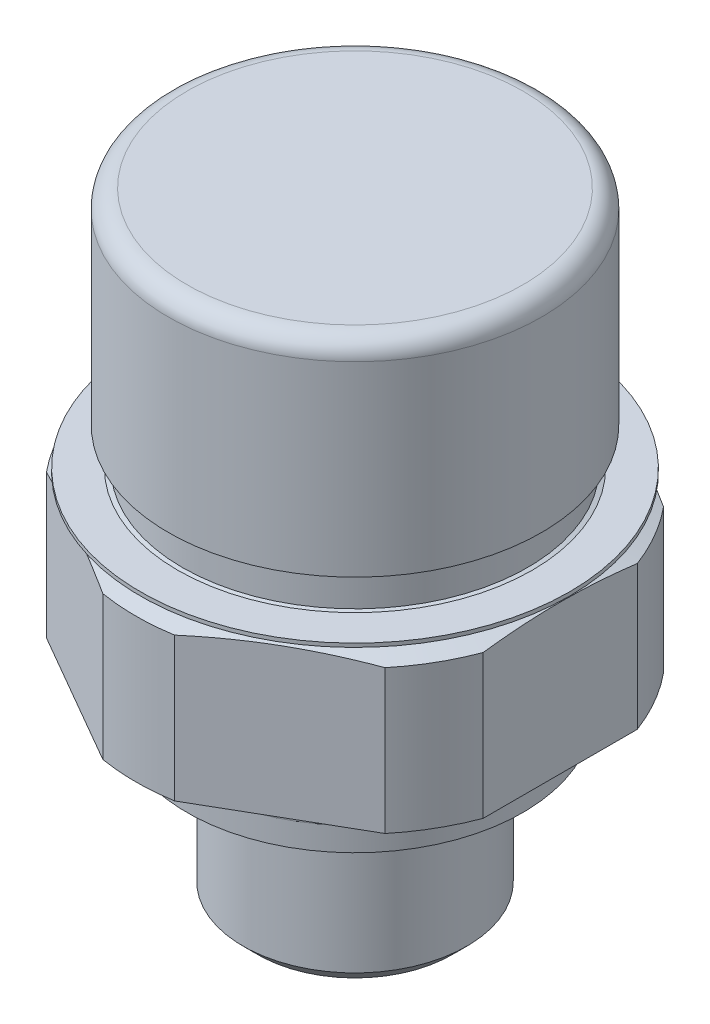
ISO-10303-21;
HEADER;
FILE_DESCRIPTION(('STEP AP214'),'2;1');
FILE_NAME('part.step','',(''),(''),'','','');
FILE_SCHEMA(('AUTOMOTIVE_DESIGN { 1 0 10303 214 1 1 1 1 }'));
ENDSEC;
DATA;
#1=APPLICATION_CONTEXT('core data for automotive mechanical design processes');
#2=APPLICATION_PROTOCOL_DEFINITION('international standard','automotive_design',2000,#1);
#3=PRODUCT_CONTEXT('',#1,'mechanical');
#4=PRODUCT('Part','Part','',(#3));
#5=PRODUCT_RELATED_PRODUCT_CATEGORY('part','',(#4));
#6=PRODUCT_DEFINITION_FORMATION('','',#4);
#7=PRODUCT_DEFINITION_CONTEXT('part definition',#1,'design');
#8=PRODUCT_DEFINITION('design','',#6,#7);
#9=PRODUCT_DEFINITION_SHAPE('','',#8);
#10=(LENGTH_UNIT() NAMED_UNIT(*) SI_UNIT(.MILLI.,.METRE.));
#11=(NAMED_UNIT(*) PLANE_ANGLE_UNIT() SI_UNIT($,.RADIAN.));
#12=(NAMED_UNIT(*) SI_UNIT($,.STERADIAN.) SOLID_ANGLE_UNIT());
#13=UNCERTAINTY_MEASURE_WITH_UNIT(LENGTH_MEASURE(1.E-05),#10,'distance_accuracy_value','');
#14=(GEOMETRIC_REPRESENTATION_CONTEXT(3) GLOBAL_UNCERTAINTY_ASSIGNED_CONTEXT((#13)) GLOBAL_UNIT_ASSIGNED_CONTEXT((#10,
#11,#12)) REPRESENTATION_CONTEXT('',''));
#15=CARTESIAN_POINT('',(0.,0.,0.));
#16=DIRECTION('',(0.,0.,1.));
#17=DIRECTION('',(1.,0.,0.));
#18=AXIS2_PLACEMENT_3D('',#15,#16,#17);
#19=CARTESIAN_POINT('',(0.,11.5,0.));
#20=DIRECTION('',(0.,-1.,0.));
#21=DIRECTION('',(0.,0.,-1.));
#22=AXIS2_PLACEMENT_3D('',#19,#20,#21);
#23=CONICAL_SURFACE('',#22,9.,1.22173047639603);
#24=CARTESIAN_POINT('',(0.,10.4990818557679,0.));
#25=DIRECTION('',(0.,-1.,0.));
#26=DIRECTION('',(0.,0.,-1.));
#27=AXIS2_PLACEMENT_3D('',#24,#25,#26);
#28=CIRCLE('',#27,11.75);
#29=CARTESIAN_POINT('',(11.,10.4990818557679,4.13067791046458));
#30=VERTEX_POINT('',#29);
#31=CARTESIAN_POINT('',(9.07727200531355,10.4990818557679,7.46094048639654));
#32=VERTEX_POINT('',#31);
#33=EDGE_CURVE('E148',#30,#32,#28,.T.);
#34=ORIENTED_EDGE('',*,*,#33,.F.);
#35=CARTESIAN_POINT('',(11.,6.75590904600755,19.0921349584983));
#36=CARTESIAN_POINT('',(11.,6.87474807178604,18.7152833554818));
#37=CARTESIAN_POINT('',(11.,6.9928056435252,18.3381837701922));
#38=CARTESIAN_POINT('',(11.,7.2270814004805,17.5834084022549));
#39=CARTESIAN_POINT('',(11.,7.34329956116789,17.2057326119971));
#40=CARTESIAN_POINT('',(11.,7.57364333418138,16.449647661278));
#41=CARTESIAN_POINT('',(11.,7.68776845885472,16.0712383520636));
#42=CARTESIAN_POINT('',(11.,7.91355008005393,15.3136843475574));
#43=CARTESIAN_POINT('',(11.,8.02520658366512,14.9345396543796));
#44=CARTESIAN_POINT('',(11.,8.24726437654446,14.1698048222856));
#45=CARTESIAN_POINT('',(11.,8.3576227591695,13.7842022049827));
#46=CARTESIAN_POINT('',(11.,8.57484488842874,13.0120139440018));
#47=CARTESIAN_POINT('',(11.,8.68170865089805,12.6254283047867));
#48=CARTESIAN_POINT('',(11.,8.89130375420541,11.8511464817657));
#49=CARTESIAN_POINT('',(11.,8.99403520081575,11.4634503266573));
#50=CARTESIAN_POINT('',(11.,9.19460044105861,10.6867897862054));
#51=CARTESIAN_POINT('',(11.,9.2924342401206,10.2978254022684));
#52=CARTESIAN_POINT('',(11.,9.47822832068293,9.53510411530176));
#53=CARTESIAN_POINT('',(11.,9.56643178705642,9.16140663413521));
#54=CARTESIAN_POINT('',(11.,9.73654082793261,8.41257312414679));
#55=CARTESIAN_POINT('',(11.,9.8184463735271,8.03743708873009));
#56=CARTESIAN_POINT('',(11.,9.97484840060975,7.28558081931047));
#57=CARTESIAN_POINT('',(11.,10.0493442197886,6.90886044682467));
#58=CARTESIAN_POINT('',(11.,10.1896526498076,6.15379020743366));
#59=CARTESIAN_POINT('',(11.,10.2554651363306,5.77544031727911));
#60=CARTESIAN_POINT('',(11.,10.3765569313355,5.02003892816318));
#61=CARTESIAN_POINT('',(11.,10.4319135503916,4.64299991496271));
#62=CARTESIAN_POINT('',(11.,10.5313293428193,3.88745029598032));
#63=CARTESIAN_POINT('',(11.,10.5753893465937,3.50893980044326));
#64=CARTESIAN_POINT('',(11.,10.6509071171795,2.75075306110334));
#65=CARTESIAN_POINT('',(11.,10.682368270039,2.37107715819286));
#66=CARTESIAN_POINT('',(11.,10.731649384444,1.61083205677763));
#67=CARTESIAN_POINT('',(11.,10.7494693201107,1.23026285657958));
#68=CARTESIAN_POINT('',(11.,10.7717555615651,0.434888530660449));
#69=CARTESIAN_POINT('',(11.,10.7748951075862,0.020045097803278));
#70=CARTESIAN_POINT('',(11.,10.7640712199422,-0.809417941482109));
#71=CARTESIAN_POINT('',(11.,10.7501075660731,-1.22403754495976));
#72=CARTESIAN_POINT('',(11.,10.7056917644412,-2.05251048362773));
#73=CARTESIAN_POINT('',(11.,10.6752345882296,-2.46636354648942));
#74=CARTESIAN_POINT('',(11.,10.5990780142224,-3.29264171450689));
#75=CARTESIAN_POINT('',(11.,10.5533784062928,-3.70506679989721));
#76=CARTESIAN_POINT('',(11.,10.3950011395301,-4.94659186883785));
#77=CARTESIAN_POINT('',(11.,10.2614622984955,-5.77306407600658));
#78=CARTESIAN_POINT('',(11.,10.030557454511,-7.00675320095458));
#79=CARTESIAN_POINT('',(11.,9.94848285414917,-7.4170085208227));
#80=CARTESIAN_POINT('',(11.,9.77573164963903,-8.23572034157804));
#81=CARTESIAN_POINT('',(11.,9.68505505720981,-8.64417684491513));
#82=CARTESIAN_POINT('',(11.,9.49197613918598,-9.47903784680741));
#83=CARTESIAN_POINT('',(11.,9.38921946153637,-9.90535967618147));
#84=CARTESIAN_POINT('',(11.,9.17717247619389,-10.7563713620037));
#85=CARTESIAN_POINT('',(11.,9.0678821565188,-11.1810612154574));
#86=CARTESIAN_POINT('',(11.,8.8438933429389,-12.0289894484477));
#87=CARTESIAN_POINT('',(11.,8.72919506224634,-12.4522278845028));
#88=CARTESIAN_POINT('',(11.,8.49529831513801,-13.2974602418844));
#89=CARTESIAN_POINT('',(11.,8.37609981182679,-13.7194541529771));
#90=CARTESIAN_POINT('',(11.,8.13596808729427,-14.5553167228647));
#91=CARTESIAN_POINT('',(11.,8.01509714832268,-14.9692033111902));
#92=CARTESIAN_POINT('',(11.,7.77029269538235,-15.79607024919));
#93=CARTESIAN_POINT('',(11.,7.64635916959943,-16.2090505953617));
#94=CARTESIAN_POINT('',(11.,7.39593564656345,-17.0341114835098));
#95=CARTESIAN_POINT('',(11.,7.26944635428796,-17.4461922397942));
#96=CARTESIAN_POINT('',(11.,7.01424965179622,-18.269658383894));
#97=CARTESIAN_POINT('',(11.,6.8855422825194,-18.68104378439));
#98=CARTESIAN_POINT('',(11.,6.75590904600756,-19.0921349584983));
#99=B_SPLINE_CURVE_WITH_KNOTS('',3,(#35,#36,#37,#38,#39,#40,#41,#42,#43,#44,#45,#46,#47,#48,#49,
#50,#51,#52,#53,#54,#55,#56,#57,#58,#59,#60,#61,#62,#63,#64,#65,#66,#67,#68,#69,#70,#71,#72,#73,
#74,#75,#76,#77,#78,#79,#80,#81,#82,#83,#84,#85,#86,#87,#88,#89,#90,#91,#92,#93,#94,#95,#96,#97,
#98),.UNSPECIFIED.,.F.,.F.,(4,2,2,2,2,2,2,2,2,2,2,2,2,2,2,2,2,2,2,2,2,2,2,2,2,2,2,2,2,2,2,4),
(0.,1.18543739308644,2.3708905808141,3.5566165435785,4.7423391026759,5.94557711106011,
7.14880966647767,8.35201140388794,9.55521180741589,10.7070631970837,11.8589198735715,
13.0108794150146,14.1628554469963,15.305948299226,16.4489570997374,17.5916585004185,
18.7343620689112,19.9785681099575,21.2227901703389,22.4673917756135,23.7120105398161,
26.2218740194445,27.4769833489083,28.7320909684718,30.0476255873544,31.3631626189058,
32.678647827885,33.9941438243214,35.2876551179094,36.5811714021086,37.8743356289115,
39.1674760130758),.UNSPECIFIED.);
#100=CARTESIAN_POINT('',(11.,10.4990818557679,-4.13067791046458));
#101=VERTEX_POINT('',#100);
#102=EDGE_CURVE('E242',#30,#101,#99,.T.);
#103=ORIENTED_EDGE('',*,*,#102,.T.);
#104=CARTESIAN_POINT('',(9.07727200531355,10.4990818557679,-7.46094048639654));
#105=VERTEX_POINT('',#104);
#106=EDGE_CURVE('E136',#105,#101,#28,.T.);
#107=ORIENTED_EDGE('',*,*,#106,.F.);
#108=CARTESIAN_POINT('',(9.07862544622409,10.4988818557679,-7.4601590769225));
#109=CARTESIAN_POINT('',(8.78137305145271,10.5428462724424,-7.63177782706102));
#110=CARTESIAN_POINT('',(8.48356742122965,10.5820359892877,-7.80371598783649));
#111=CARTESIAN_POINT('',(7.88702267637257,10.6500395482173,-8.14813125686338));
#112=CARTESIAN_POINT('',(7.58828341527745,10.6788516704479,-8.32060844967416));
#113=CARTESIAN_POINT('',(6.99144551971995,10.7251573934758,-8.66519296933685));
#114=CARTESIAN_POINT('',(6.69334976152614,10.7426997416824,-8.83729863557433));
#115=CARTESIAN_POINT('',(6.09683598418274,10.7661503552958,-9.18169602549886));
#116=CARTESIAN_POINT('',(5.79841799209137,10.7720595314676,-9.35398773356384));
#117=CARTESIAN_POINT('',(5.20158200790863,10.7720595314676,-9.69857114969381));
#118=CARTESIAN_POINT('',(4.90316401581725,10.7661503552958,-9.87086285775879));
#119=CARTESIAN_POINT('',(4.30665023847386,10.7426997416824,-10.2152602476833));
#120=CARTESIAN_POINT('',(4.00855448028005,10.7251573934758,-10.3873659139208));
#121=CARTESIAN_POINT('',(3.41171658472255,10.6788516704479,-10.7319504335835));
#122=CARTESIAN_POINT('',(3.11297732362743,10.6500395482173,-10.9044276263943));
#123=CARTESIAN_POINT('',(2.51643257877035,10.5820359892877,-11.2488428954212));
#124=CARTESIAN_POINT('',(2.21862694854729,10.5428462724424,-11.4207810561966));
#125=CARTESIAN_POINT('',(1.9213745537759,10.4988818557679,-11.5923998063352));
#126=B_SPLINE_CURVE_WITH_KNOTS('',3,(#108,#109,#110,#111,#112,#113,#114,#115,#116,#117,#118,
#119,#120,#121,#122,#123,#124,#125),.UNSPECIFIED.,.F.,.F.,(4,2,2,2,2,2,2,2,4),(0.,
1.03813210498496,2.07643617802459,3.11021827735299,4.14391943832069,5.17762059928839,
6.2114026986168,7.24970677165642,8.28783887664139),.UNSPECIFIED.);
#127=CARTESIAN_POINT('',(1.92272799468645,10.4990818557679,-11.5916183968611));
#128=VERTEX_POINT('',#127);
#129=EDGE_CURVE('E197',#105,#128,#126,.T.);
#130=ORIENTED_EDGE('',*,*,#129,.T.);
#131=CARTESIAN_POINT('',(-1.92272799468644,10.4990818557679,-11.5916183968611));
#132=VERTEX_POINT('',#131);
#133=EDGE_CURVE('E147',#132,#128,#28,.T.);
#134=ORIENTED_EDGE('',*,*,#133,.F.);
#135=CARTESIAN_POINT('',(-1.92137455377591,10.4988818557679,-11.5923998063352));
#136=CARTESIAN_POINT('',(-2.21862694854729,10.5428462724424,-11.4207810561966));
#137=CARTESIAN_POINT('',(-2.51643257877036,10.5820359892877,-11.2488428954212));
#138=CARTESIAN_POINT('',(-3.11297732362744,10.6500395482173,-10.9044276263943));
#139=CARTESIAN_POINT('',(-3.41171658472256,10.6788516704479,-10.7319504335835));
#140=CARTESIAN_POINT('',(-4.00855448028007,10.7251573934758,-10.3873659139208));
#141=CARTESIAN_POINT('',(-4.30665023847388,10.7426997416824,-10.2152602476833));
#142=CARTESIAN_POINT('',(-4.90316401581728,10.7661503552958,-9.87086285775877));
#143=CARTESIAN_POINT('',(-5.20158200790865,10.7720595314676,-9.69857114969379));
#144=CARTESIAN_POINT('',(-5.7984179920914,10.7720595314676,-9.35398773356382));
#145=CARTESIAN_POINT('',(-6.09683598418278,10.7661503552958,-9.18169602549884));
#146=CARTESIAN_POINT('',(-6.69334976152618,10.7426997416824,-8.83729863557431));
#147=CARTESIAN_POINT('',(-6.99144551971999,10.7251573934758,-8.66519296933683));
#148=CARTESIAN_POINT('',(-7.58828341527749,10.6788516704479,-8.32060844967413));
#149=CARTESIAN_POINT('',(-7.88702267637262,10.6500395482173,-8.14813125686335));
#150=CARTESIAN_POINT('',(-8.4835674212297,10.5820359892877,-7.80371598783646));
#151=CARTESIAN_POINT('',(-8.78137305145277,10.5428462724424,-7.63177782706098));
#152=CARTESIAN_POINT('',(-9.07862544622415,10.4988818557679,-7.46015907692247));
#153=B_SPLINE_CURVE_WITH_KNOTS('',3,(#135,#136,#137,#138,#139,#140,#141,#142,#143,#144,#145,
#146,#147,#148,#149,#150,#151,#152),.UNSPECIFIED.,.F.,.F.,(4,2,2,2,2,2,2,2,4),(0.,
1.03813210498497,2.0764361780246,3.11021827735302,4.14391943832073,5.17762059928844,
6.21140269861685,7.24970677165648,8.28783887664146),.UNSPECIFIED.);
#154=CARTESIAN_POINT('',(-9.07727200531355,10.4990818557679,-7.46094048639654));
#155=VERTEX_POINT('',#154);
#156=EDGE_CURVE('E199',#132,#155,#153,.T.);
#157=ORIENTED_EDGE('',*,*,#156,.T.);
#158=CARTESIAN_POINT('',(-11.,10.4990818557679,-4.13067791046458));
#159=VERTEX_POINT('',#158);
#160=EDGE_CURVE('E413',#159,#155,#28,.T.);
#161=ORIENTED_EDGE('',*,*,#160,.F.);
#162=CARTESIAN_POINT('',(-11.,6.75590904600755,-19.0921349584983));
#163=CARTESIAN_POINT('',(-11.,6.87474807178604,-18.7152833554818));
#164=CARTESIAN_POINT('',(-11.,6.9928056435252,-18.3381837701922));
#165=CARTESIAN_POINT('',(-11.,7.2270814004805,-17.5834084022549));
#166=CARTESIAN_POINT('',(-11.,7.34329956116789,-17.2057326119971));
#167=CARTESIAN_POINT('',(-11.,7.57364333418138,-16.449647661278));
#168=CARTESIAN_POINT('',(-11.,7.68776845885472,-16.0712383520636));
#169=CARTESIAN_POINT('',(-11.,7.91355008005393,-15.3136843475574));
#170=CARTESIAN_POINT('',(-11.,8.02520658366512,-14.9345396543796));
#171=CARTESIAN_POINT('',(-11.,8.24726437654446,-14.1698048222856));
#172=CARTESIAN_POINT('',(-11.,8.3576227591695,-13.7842022049827));
#173=CARTESIAN_POINT('',(-11.,8.57484488842874,-13.0120139440018));
#174=CARTESIAN_POINT('',(-11.,8.68170865089805,-12.6254283047867));
#175=CARTESIAN_POINT('',(-11.,8.89130375420541,-11.8511464817657));
#176=CARTESIAN_POINT('',(-11.,8.99403520081575,-11.4634503266573));
#177=CARTESIAN_POINT('',(-11.,9.19460044105861,-10.6867897862054));
#178=CARTESIAN_POINT('',(-11.,9.2924342401206,-10.2978254022684));
#179=CARTESIAN_POINT('',(-11.,9.47822832068293,-9.53510411530176));
#180=CARTESIAN_POINT('',(-11.,9.56643178705642,-9.16140663413521));
#181=CARTESIAN_POINT('',(-11.,9.73654082793261,-8.41257312414679));
#182=CARTESIAN_POINT('',(-11.,9.8184463735271,-8.03743708873009));
#183=CARTESIAN_POINT('',(-11.,9.97484840060975,-7.28558081931047));
#184=CARTESIAN_POINT('',(-11.,10.0493442197886,-6.90886044682467));
#185=CARTESIAN_POINT('',(-11.,10.1896526498076,-6.15379020743366));
#186=CARTESIAN_POINT('',(-11.,10.2554651363306,-5.77544031727911));
#187=CARTESIAN_POINT('',(-11.,10.3765569313355,-5.02003892816318));
#188=CARTESIAN_POINT('',(-11.,10.4319135503916,-4.64299991496271));
#189=CARTESIAN_POINT('',(-11.,10.5313293428193,-3.88745029598032));
#190=CARTESIAN_POINT('',(-11.,10.5753893465937,-3.50893980044326));
#191=CARTESIAN_POINT('',(-11.,10.6509071171795,-2.75075306110334));
#192=CARTESIAN_POINT('',(-11.,10.682368270039,-2.37107715819286));
#193=CARTESIAN_POINT('',(-11.,10.731649384444,-1.61083205677763));
#194=CARTESIAN_POINT('',(-11.,10.7494693201107,-1.23026285657958));
#195=CARTESIAN_POINT('',(-11.,10.7717555615651,-0.434888530660449));
#196=CARTESIAN_POINT('',(-11.,10.7748951075862,-0.020045097803278));
#197=CARTESIAN_POINT('',(-11.,10.7640712199422,0.809417941482109));
#198=CARTESIAN_POINT('',(-11.,10.7501075660731,1.22403754495976));
#199=CARTESIAN_POINT('',(-11.,10.7056917644412,2.05251048362773));
#200=CARTESIAN_POINT('',(-11.,10.6752345882296,2.46636354648942));
#201=CARTESIAN_POINT('',(-11.,10.5990780142224,3.29264171450689));
#202=CARTESIAN_POINT('',(-11.,10.5533784062928,3.70506679989721));
#203=CARTESIAN_POINT('',(-11.,10.3950011395301,4.94659186883785));
#204=CARTESIAN_POINT('',(-11.,10.2614622984955,5.77306407600658));
#205=CARTESIAN_POINT('',(-11.,10.030557454511,7.00675320095458));
#206=CARTESIAN_POINT('',(-11.,9.94848285414917,7.4170085208227));
#207=CARTESIAN_POINT('',(-11.,9.77573164963903,8.23572034157804));
#208=CARTESIAN_POINT('',(-11.,9.68505505720981,8.64417684491513));
#209=CARTESIAN_POINT('',(-11.,9.49197613918598,9.47903784680741));
#210=CARTESIAN_POINT('',(-11.,9.38921946153637,9.90535967618147));
#211=CARTESIAN_POINT('',(-11.,9.17717247619389,10.7563713620037));
#212=CARTESIAN_POINT('',(-11.,9.0678821565188,11.1810612154574));
#213=CARTESIAN_POINT('',(-11.,8.8438933429389,12.0289894484477));
#214=CARTESIAN_POINT('',(-11.,8.72919506224634,12.4522278845028));
#215=CARTESIAN_POINT('',(-11.,8.49529831513801,13.2974602418844));
#216=CARTESIAN_POINT('',(-11.,8.37609981182679,13.7194541529771));
#217=CARTESIAN_POINT('',(-11.,8.13596808729427,14.5553167228647));
#218=CARTESIAN_POINT('',(-11.,8.01509714832268,14.9692033111902));
#219=CARTESIAN_POINT('',(-11.,7.77029269538235,15.79607024919));
#220=CARTESIAN_POINT('',(-11.,7.64635916959943,16.2090505953617));
#221=CARTESIAN_POINT('',(-11.,7.39593564656345,17.0341114835098));
#222=CARTESIAN_POINT('',(-11.,7.26944635428796,17.4461922397942));
#223=CARTESIAN_POINT('',(-11.,7.01424965179622,18.269658383894));
#224=CARTESIAN_POINT('',(-11.,6.8855422825194,18.68104378439));
#225=CARTESIAN_POINT('',(-11.,6.75590904600756,19.0921349584983));
#226=B_SPLINE_CURVE_WITH_KNOTS('',3,(#162,#163,#164,#165,#166,#167,#168,#169,#170,#171,#172,
#173,#174,#175,#176,#177,#178,#179,#180,#181,#182,#183,#184,#185,#186,#187,#188,#189,#190,#191,
#192,#193,#194,#195,#196,#197,#198,#199,#200,#201,#202,#203,#204,#205,#206,#207,#208,#209,#210,
#211,#212,#213,#214,#215,#216,#217,#218,#219,#220,#221,#222,#223,#224,#225),.UNSPECIFIED.,.F.,
.F.,(4,2,2,2,2,2,2,2,2,2,2,2,2,2,2,2,2,2,2,2,2,2,2,2,2,2,2,2,2,2,2,4),(0.,1.18543739308644,
2.3708905808141,3.5566165435785,4.7423391026759,5.94557711106011,7.14880966647767,
8.35201140388794,9.55521180741589,10.7070631970837,11.8589198735715,13.0108794150146,
14.1628554469963,15.305948299226,16.4489570997374,17.5916585004185,18.7343620689112,
19.9785681099575,21.2227901703389,22.4673917756135,23.7120105398161,26.2218740194445,
27.4769833489083,28.7320909684718,30.0476255873544,31.3631626189058,32.678647827885,
33.9941438243214,35.2876551179094,36.5811714021086,37.8743356289115,39.1674760130758),.UNSPECIFIED.);
#227=CARTESIAN_POINT('',(-11.,10.4990818557679,4.13067791046458));
#228=VERTEX_POINT('',#227);
#229=EDGE_CURVE('E412',#159,#228,#226,.T.);
#230=ORIENTED_EDGE('',*,*,#229,.T.);
#231=CARTESIAN_POINT('',(-9.07727200531355,10.4990818557679,7.46094048639654));
#232=VERTEX_POINT('',#231);
#233=EDGE_CURVE('E410',#232,#228,#28,.T.);
#234=ORIENTED_EDGE('',*,*,#233,.F.);
#235=CARTESIAN_POINT('',(-9.07862544622415,10.4988818557679,7.46015907692247));
#236=CARTESIAN_POINT('',(-8.78137305145277,10.5428462724424,7.63177782706098));
#237=CARTESIAN_POINT('',(-8.4835674212297,10.5820359892877,7.80371598783646));
#238=CARTESIAN_POINT('',(-7.88702267637262,10.6500395482173,8.14813125686335));
#239=CARTESIAN_POINT('',(-7.5882834152775,10.6788516704479,8.32060844967413));
#240=CARTESIAN_POINT('',(-6.99144551971999,10.7251573934758,8.66519296933683));
#241=CARTESIAN_POINT('',(-6.69334976152618,10.7426997416824,8.83729863557431));
#242=CARTESIAN_POINT('',(-6.09683598418278,10.7661503552958,9.18169602549884));
#243=CARTESIAN_POINT('',(-5.79841799209141,10.7720595314676,9.35398773356382));
#244=CARTESIAN_POINT('',(-5.20158200790865,10.7720595314676,9.69857114969379));
#245=CARTESIAN_POINT('',(-4.90316401581728,10.7661503552958,9.87086285775877));
#246=CARTESIAN_POINT('',(-4.30665023847388,10.7426997416824,10.2152602476833));
#247=CARTESIAN_POINT('',(-4.00855448028007,10.7251573934758,10.3873659139208));
#248=CARTESIAN_POINT('',(-3.41171658472256,10.6788516704479,10.7319504335835));
#249=CARTESIAN_POINT('',(-3.11297732362744,10.6500395482173,10.9044276263943));
#250=CARTESIAN_POINT('',(-2.51643257877036,10.5820359892877,11.2488428954212));
#251=CARTESIAN_POINT('',(-2.21862694854729,10.5428462724424,11.4207810561966));
#252=CARTESIAN_POINT('',(-1.92137455377591,10.4988818557679,11.5923998063351));
#253=B_SPLINE_CURVE_WITH_KNOTS('',3,(#235,#236,#237,#238,#239,#240,#241,#242,#243,#244,#245,
#246,#247,#248,#249,#250,#251,#252),.UNSPECIFIED.,.F.,.F.,(4,2,2,2,2,2,2,2,4),(0.,
1.03813210498497,2.0764361780246,3.11021827735302,4.14391943832073,5.17762059928844,
6.21140269861685,7.24970677165648,8.28783887664146),.UNSPECIFIED.);
#254=CARTESIAN_POINT('',(-1.92272799468645,10.4990818557679,11.5916183968611));
#255=VERTEX_POINT('',#254);
#256=EDGE_CURVE('E128',#232,#255,#253,.T.);
#257=ORIENTED_EDGE('',*,*,#256,.T.);
#258=CARTESIAN_POINT('',(1.92272799468644,10.4990818557679,11.5916183968611));
#259=VERTEX_POINT('',#258);
#260=EDGE_CURVE('E126',#259,#255,#28,.T.);
#261=ORIENTED_EDGE('',*,*,#260,.F.);
#262=CARTESIAN_POINT('',(1.92137455377591,10.4988818557679,11.5923998063352));
#263=CARTESIAN_POINT('',(2.21862694854729,10.5428462724424,11.4207810561966));
#264=CARTESIAN_POINT('',(2.51643257877035,10.5820359892877,11.2488428954212));
#265=CARTESIAN_POINT('',(3.11297732362743,10.6500395482173,10.9044276263943));
#266=CARTESIAN_POINT('',(3.41171658472255,10.6788516704479,10.7319504335835));
#267=CARTESIAN_POINT('',(4.00855448028005,10.7251573934758,10.3873659139208));
#268=CARTESIAN_POINT('',(4.30665023847386,10.7426997416824,10.2152602476833));
#269=CARTESIAN_POINT('',(4.90316401581725,10.7661503552958,9.87086285775879));
#270=CARTESIAN_POINT('',(5.20158200790863,10.7720595314676,9.69857114969381));
#271=CARTESIAN_POINT('',(5.79841799209137,10.7720595314676,9.35398773356384));
#272=CARTESIAN_POINT('',(6.09683598418274,10.7661503552958,9.18169602549886));
#273=CARTESIAN_POINT('',(6.69334976152614,10.7426997416824,8.83729863557433));
#274=CARTESIAN_POINT('',(6.99144551971995,10.7251573934758,8.66519296933685));
#275=CARTESIAN_POINT('',(7.58828341527745,10.6788516704479,8.32060844967416));
#276=CARTESIAN_POINT('',(7.88702267637257,10.6500395482173,8.14813125686338));
#277=CARTESIAN_POINT('',(8.48356742122965,10.5820359892877,7.80371598783649));
#278=CARTESIAN_POINT('',(8.78137305145271,10.5428462724424,7.63177782706102));
#279=CARTESIAN_POINT('',(9.07862544622409,10.4988818557679,7.4601590769225));
#280=B_SPLINE_CURVE_WITH_KNOTS('',3,(#262,#263,#264,#265,#266,#267,#268,#269,#270,#271,#272,
#273,#274,#275,#276,#277,#278,#279),.UNSPECIFIED.,.F.,.F.,(4,2,2,2,2,2,2,2,4),(0.,
1.03813210498496,2.07643617802459,3.11021827735299,4.14391943832069,5.17762059928839,
6.2114026986168,7.24970677165642,8.28783887664139),.UNSPECIFIED.);
#281=EDGE_CURVE('E268',#259,#32,#280,.T.);
#282=ORIENTED_EDGE('',*,*,#281,.T.);
#283=EDGE_LOOP('',(#34,#103,#107,#130,#134,#157,#161,#230,#234,#257,#261,#282));
#284=FACE_BOUND('',#283,.T.);
#285=CARTESIAN_POINT('',(0.,11.3,0.));
#286=DIRECTION('',(0.,1.,0.));
#287=DIRECTION('',(0.,0.,1.));
#288=AXIS2_PLACEMENT_3D('',#285,#286,#287);
#289=CIRCLE('',#288,9.54949548389092);
#290=CARTESIAN_POINT('',(0.,11.3,9.54949548389092));
#291=VERTEX_POINT('',#290);
#292=EDGE_CURVE('E10',#291,#291,#289,.T.);
#293=ORIENTED_EDGE('',*,*,#292,.F.);
#294=EDGE_LOOP('',(#293));
#295=FACE_BOUND('',#294,.T.);
#296=ADVANCED_FACE('F16',(#284,#295),#23,.T.);
#297=CARTESIAN_POINT('',(0.,0.,0.));
#298=DIRECTION('',(0.,-1.,0.));
#299=DIRECTION('',(0.,0.,-1.));
#300=AXIS2_PLACEMENT_3D('',#297,#298,#299);
#301=CYLINDRICAL_SURFACE('',#300,11.75);
#302=ORIENTED_EDGE('',*,*,#233,.T.);
#303=DIRECTION('',(0.,-1.,0.));
#304=VECTOR('',#303,1.);
#305=CARTESIAN_POINT('',(-11.,0.,4.13067791046458));
#306=LINE('',#305,#304);
#307=CARTESIAN_POINT('',(-11.,2.8,4.13067791046457));
#308=VERTEX_POINT('',#307);
#309=EDGE_CURVE('E414',#228,#308,#306,.T.);
#310=ORIENTED_EDGE('',*,*,#309,.T.);
#311=CARTESIAN_POINT('',(0.,2.8,0.));
#312=DIRECTION('',(0.,-1.,0.));
#313=DIRECTION('',(0.,0.,-1.));
#314=AXIS2_PLACEMENT_3D('',#311,#312,#313);
#315=CIRCLE('',#314,11.75);
#316=CARTESIAN_POINT('',(-9.07727200531354,2.8,7.46094048639655));
#317=VERTEX_POINT('',#316);
#318=EDGE_CURVE('E134',#317,#308,#315,.T.);
#319=ORIENTED_EDGE('',*,*,#318,.F.);
#320=DIRECTION('',(0.,-1.,0.));
#321=VECTOR('',#320,1.);
#322=CARTESIAN_POINT('',(-9.07727200531355,0.,7.46094048639654));
#323=LINE('',#322,#321);
#324=EDGE_CURVE('E111',#317,#232,#323,.F.);
#325=ORIENTED_EDGE('',*,*,#324,.T.);
#326=EDGE_LOOP('',(#302,#310,#319,#325));
#327=FACE_BOUND('',#326,.T.);
#328=ADVANCED_FACE('F324',(#327),#301,.T.);
#329=CARTESIAN_POINT('',(-11.,2.8,-4.13067791046458));
#330=VERTEX_POINT('',#329);
#331=CARTESIAN_POINT('',(-9.07727200531355,2.8,-7.46094048639654));
#332=VERTEX_POINT('',#331);
#333=EDGE_CURVE('E138',#330,#332,#315,.T.);
#334=ORIENTED_EDGE('',*,*,#333,.F.);
#335=DIRECTION('',(0.,-1.,0.));
#336=VECTOR('',#335,1.);
#337=CARTESIAN_POINT('',(-11.,0.,-4.13067791046458));
#338=LINE('',#337,#336);
#339=EDGE_CURVE('E184',#330,#159,#338,.F.);
#340=ORIENTED_EDGE('',*,*,#339,.T.);
#341=ORIENTED_EDGE('',*,*,#160,.T.);
#342=DIRECTION('',(0.,-1.,0.));
#343=VECTOR('',#342,1.);
#344=CARTESIAN_POINT('',(-9.07727200531355,0.,-7.46094048639653));
#345=LINE('',#344,#343);
#346=EDGE_CURVE('E186',#155,#332,#345,.T.);
#347=ORIENTED_EDGE('',*,*,#346,.T.);
#348=EDGE_LOOP('',(#334,#340,#341,#347));
#349=FACE_BOUND('',#348,.T.);
#350=ADVANCED_FACE('F182',(#349),#301,.T.);
#351=CARTESIAN_POINT('',(-1.92272799468645,2.8,-11.5916183968611));
#352=VERTEX_POINT('',#351);
#353=CARTESIAN_POINT('',(1.92272799468645,2.8,-11.5916183968611));
#354=VERTEX_POINT('',#353);
#355=EDGE_CURVE('E142',#352,#354,#315,.T.);
#356=ORIENTED_EDGE('',*,*,#355,.F.);
#357=DIRECTION('',(0.,-1.,0.));
#358=VECTOR('',#357,1.);
#359=CARTESIAN_POINT('',(-1.92272799468644,0.,-11.5916183968611));
#360=LINE('',#359,#358);
#361=EDGE_CURVE('E40',#352,#132,#360,.F.);
#362=ORIENTED_EDGE('',*,*,#361,.T.);
#363=ORIENTED_EDGE('',*,*,#133,.T.);
#364=DIRECTION('',(0.,-1.,0.));
#365=VECTOR('',#364,1.);
#366=CARTESIAN_POINT('',(1.92272799468645,0.,-11.5916183968611));
#367=LINE('',#366,#365);
#368=EDGE_CURVE('E195',#128,#354,#367,.T.);
#369=ORIENTED_EDGE('',*,*,#368,.T.);
#370=EDGE_LOOP('',(#356,#362,#363,#369));
#371=FACE_BOUND('',#370,.T.);
#372=ADVANCED_FACE('F192',(#371),#301,.T.);
#373=CARTESIAN_POINT('',(11.,2.8,4.13067791046458));
#374=VERTEX_POINT('',#373);
#375=CARTESIAN_POINT('',(9.07727200531354,2.8,7.46094048639654));
#376=VERTEX_POINT('',#375);
#377=EDGE_CURVE('E133',#374,#376,#315,.T.);
#378=ORIENTED_EDGE('',*,*,#377,.F.);
#379=DIRECTION('',(0.,-1.,0.));
#380=VECTOR('',#379,1.);
#381=CARTESIAN_POINT('',(11.,0.,4.13067791046458));
#382=LINE('',#381,#380);
#383=EDGE_CURVE('E251',#374,#30,#382,.F.);
#384=ORIENTED_EDGE('',*,*,#383,.T.);
#385=ORIENTED_EDGE('',*,*,#33,.T.);
#386=DIRECTION('',(0.,-1.,0.));
#387=VECTOR('',#386,1.);
#388=CARTESIAN_POINT('',(9.07727200531355,0.,7.46094048639653));
#389=LINE('',#388,#387);
#390=EDGE_CURVE('E267',#32,#376,#389,.T.);
#391=ORIENTED_EDGE('',*,*,#390,.T.);
#392=EDGE_LOOP('',(#378,#384,#385,#391));
#393=FACE_BOUND('',#392,.T.);
#394=ADVANCED_FACE('F265',(#393),#301,.T.);
#395=CARTESIAN_POINT('',(1.92272799468646,2.8,11.5916183968611));
#396=VERTEX_POINT('',#395);
#397=CARTESIAN_POINT('',(-1.92272799468646,2.8,11.5916183968611));
#398=VERTEX_POINT('',#397);
#399=EDGE_CURVE('E124',#396,#398,#315,.T.);
#400=ORIENTED_EDGE('',*,*,#399,.F.);
#401=DIRECTION('',(0.,-1.,0.));
#402=VECTOR('',#401,1.);
#403=CARTESIAN_POINT('',(1.92272799468644,0.,11.5916183968611));
#404=LINE('',#403,#402);
#405=EDGE_CURVE('E127',#396,#259,#404,.F.);
#406=ORIENTED_EDGE('',*,*,#405,.T.);
#407=ORIENTED_EDGE('',*,*,#260,.T.);
#408=DIRECTION('',(0.,-1.,0.));
#409=VECTOR('',#408,1.);
#410=CARTESIAN_POINT('',(-1.92272799468645,0.,11.5916183968611));
#411=LINE('',#410,#409);
#412=EDGE_CURVE('E108',#255,#398,#411,.T.);
#413=ORIENTED_EDGE('',*,*,#412,.T.);
#414=EDGE_LOOP('',(#400,#406,#407,#413));
#415=FACE_BOUND('',#414,.T.);
#416=ADVANCED_FACE('F122',(#415),#301,.T.);
#417=CARTESIAN_POINT('',(9.07727200531355,2.8,-7.46094048639654));
#418=VERTEX_POINT('',#417);
#419=CARTESIAN_POINT('',(11.,2.8,-4.13067791046457));
#420=VERTEX_POINT('',#419);
#421=EDGE_CURVE('E137',#418,#420,#315,.T.);
#422=ORIENTED_EDGE('',*,*,#421,.F.);
#423=DIRECTION('',(0.,-1.,0.));
#424=VECTOR('',#423,1.);
#425=CARTESIAN_POINT('',(9.07727200531355,0.,-7.46094048639654));
#426=LINE('',#425,#424);
#427=EDGE_CURVE('E32',#418,#105,#426,.F.);
#428=ORIENTED_EDGE('',*,*,#427,.T.);
#429=ORIENTED_EDGE('',*,*,#106,.T.);
#430=DIRECTION('',(0.,-1.,0.));
#431=VECTOR('',#430,1.);
#432=CARTESIAN_POINT('',(11.,0.,-4.13067791046458));
#433=LINE('',#432,#431);
#434=EDGE_CURVE('E250',#101,#420,#433,.T.);
#435=ORIENTED_EDGE('',*,*,#434,.T.);
#436=EDGE_LOOP('',(#422,#428,#429,#435));
#437=FACE_BOUND('',#436,.T.);
#438=ADVANCED_FACE('F256',(#437),#301,.T.);
#439=CARTESIAN_POINT('',(11.75,2.8,0.));
#440=DIRECTION('',(0.,1.,0.));
#441=DIRECTION('',(0.,0.,1.));
#442=AXIS2_PLACEMENT_3D('',#439,#440,#441);
#443=PLANE('',#442);
#444=CARTESIAN_POINT('',(0.,2.8,0.));
#445=DIRECTION('',(0.,-1.,0.));
#446=DIRECTION('',(0.,0.,-1.));
#447=AXIS2_PLACEMENT_3D('',#444,#445,#446);
#448=CIRCLE('',#447,9.05);
#449=CARTESIAN_POINT('',(0.,2.8,-9.05));
#450=VERTEX_POINT('',#449);
#451=EDGE_CURVE('E143',#450,#450,#448,.T.);
#452=ORIENTED_EDGE('',*,*,#451,.F.);
#453=EDGE_LOOP('',(#452));
#454=FACE_BOUND('',#453,.T.);
#455=ORIENTED_EDGE('',*,*,#318,.T.);
#456=DIRECTION('',(0.,0.,-1.));
#457=VECTOR('',#456,1.);
#458=CARTESIAN_POINT('',(-11.,2.8,0.));
#459=LINE('',#458,#457);
#460=EDGE_CURVE('E25',#308,#330,#459,.T.);
#461=ORIENTED_EDGE('',*,*,#460,.T.);
#462=ORIENTED_EDGE('',*,*,#333,.T.);
#463=DIRECTION('',(0.866025403784439,0.,-0.5));
#464=VECTOR('',#463,1.);
#465=CARTESIAN_POINT('',(3.3125,2.8,-14.6141786888624));
#466=LINE('',#465,#464);
#467=EDGE_CURVE('E172',#332,#352,#466,.T.);
#468=ORIENTED_EDGE('',*,*,#467,.T.);
#469=ORIENTED_EDGE('',*,*,#355,.T.);
#470=DIRECTION('',(0.866025403784439,0.,0.5));
#471=VECTOR('',#470,1.);
#472=CARTESIAN_POINT('',(14.3125,2.8,-4.43838019439525));
#473=LINE('',#472,#471);
#474=EDGE_CURVE('E170',#354,#418,#473,.T.);
#475=ORIENTED_EDGE('',*,*,#474,.T.);
#476=ORIENTED_EDGE('',*,*,#421,.T.);
#477=DIRECTION('',(0.,0.,1.));
#478=VECTOR('',#477,1.);
#479=CARTESIAN_POINT('',(11.,2.8,0.));
#480=LINE('',#479,#478);
#481=EDGE_CURVE('E167',#420,#374,#480,.T.);
#482=ORIENTED_EDGE('',*,*,#481,.T.);
#483=ORIENTED_EDGE('',*,*,#377,.T.);
#484=DIRECTION('',(-0.866025403784439,0.,0.5));
#485=VECTOR('',#484,1.);
#486=CARTESIAN_POINT('',(14.3125,2.8,4.43838019439525));
#487=LINE('',#486,#485);
#488=EDGE_CURVE('E116',#376,#396,#487,.T.);
#489=ORIENTED_EDGE('',*,*,#488,.T.);
#490=ORIENTED_EDGE('',*,*,#399,.T.);
#491=DIRECTION('',(-0.866025403784439,0.,-0.5));
#492=VECTOR('',#491,1.);
#493=CARTESIAN_POINT('',(3.3125,2.8,14.6141786888624));
#494=LINE('',#493,#492);
#495=EDGE_CURVE('E105',#398,#317,#494,.T.);
#496=ORIENTED_EDGE('',*,*,#495,.T.);
#497=EDGE_LOOP('',(#455,#461,#462,#468,#469,#475,#476,#482,#483,#489,#490,#496));
#498=FACE_BOUND('',#497,.T.);
#499=ADVANCED_FACE('F131',(#454,#498),#443,.F.);
#500=CARTESIAN_POINT('',(0.,0.,0.));
#501=DIRECTION('',(0.,-1.,0.));
#502=DIRECTION('',(0.,0.,-1.));
#503=AXIS2_PLACEMENT_3D('',#500,#501,#502);
#504=CYLINDRICAL_SURFACE('',#503,9.05);
#505=CARTESIAN_POINT('',(0.,1.3,0.));
#506=DIRECTION('',(0.,-1.,0.));
#507=DIRECTION('',(0.,0.,-1.));
#508=AXIS2_PLACEMENT_3D('',#505,#506,#507);
#509=CIRCLE('',#508,9.05);
#510=CARTESIAN_POINT('',(0.,1.3,-9.05));
#511=VERTEX_POINT('',#510);
#512=EDGE_CURVE('E442',#511,#511,#509,.T.);
#513=ORIENTED_EDGE('',*,*,#512,.F.);
#514=EDGE_LOOP('',(#513));
#515=FACE_BOUND('',#514,.T.);
#516=ORIENTED_EDGE('',*,*,#451,.T.);
#517=EDGE_LOOP('',(#516));
#518=FACE_BOUND('',#517,.T.);
#519=ADVANCED_FACE('F316',(#515,#518),#504,.T.);
#520=CARTESIAN_POINT('',(9.05,1.3,0.));
#521=DIRECTION('',(0.,1.,0.));
#522=DIRECTION('',(0.,0.,1.));
#523=AXIS2_PLACEMENT_3D('',#520,#521,#522);
#524=PLANE('',#523);
#525=CARTESIAN_POINT('',(0.,1.3,0.));
#526=DIRECTION('',(0.,-1.,0.));
#527=DIRECTION('',(0.,0.,-1.));
#528=AXIS2_PLACEMENT_3D('',#525,#526,#527);
#529=CIRCLE('',#528,9.);
#530=CARTESIAN_POINT('',(0.,1.3,-9.));
#531=VERTEX_POINT('',#530);
#532=EDGE_CURVE('E440',#531,#531,#529,.T.);
#533=ORIENTED_EDGE('',*,*,#532,.F.);
#534=EDGE_LOOP('',(#533));
#535=FACE_BOUND('',#534,.T.);
#536=ORIENTED_EDGE('',*,*,#512,.T.);
#537=EDGE_LOOP('',(#536));
#538=FACE_BOUND('',#537,.T.);
#539=ADVANCED_FACE('F312',(#535,#538),#524,.F.);
#540=CARTESIAN_POINT('',(0.,0.,0.));
#541=DIRECTION('',(0.,-1.,0.));
#542=DIRECTION('',(0.,0.,-1.));
#543=AXIS2_PLACEMENT_3D('',#540,#541,#542);
#544=CYLINDRICAL_SURFACE('',#543,9.);
#545=CARTESIAN_POINT('',(0.,0.,0.));
#546=DIRECTION('',(0.,-1.,0.));
#547=DIRECTION('',(0.,0.,-1.));
#548=AXIS2_PLACEMENT_3D('',#545,#546,#547);
#549=CIRCLE('',#548,9.);
#550=CARTESIAN_POINT('',(0.,0.,-9.));
#551=VERTEX_POINT('',#550);
#552=EDGE_CURVE('E437',#551,#551,#549,.T.);
#553=ORIENTED_EDGE('',*,*,#552,.F.);
#554=EDGE_LOOP('',(#553));
#555=FACE_BOUND('',#554,.T.);
#556=ORIENTED_EDGE('',*,*,#532,.T.);
#557=EDGE_LOOP('',(#556));
#558=FACE_BOUND('',#557,.T.);
#559=ADVANCED_FACE('F308',(#555,#558),#544,.T.);
#560=CARTESIAN_POINT('',(9.,0.,0.));
#561=DIRECTION('',(0.,1.,0.));
#562=DIRECTION('',(0.,0.,1.));
#563=AXIS2_PLACEMENT_3D('',#560,#561,#562);
#564=PLANE('',#563);
#565=CARTESIAN_POINT('',(0.,0.,0.));
#566=DIRECTION('',(0.,-1.,0.));
#567=DIRECTION('',(0.,0.,-1.));
#568=AXIS2_PLACEMENT_3D('',#565,#566,#567);
#569=CIRCLE('',#568,6.);
#570=CARTESIAN_POINT('',(0.,0.,-6.));
#571=VERTEX_POINT('',#570);
#572=EDGE_CURVE('E434',#571,#571,#569,.T.);
#573=ORIENTED_EDGE('',*,*,#572,.F.);
#574=EDGE_LOOP('',(#573));
#575=FACE_BOUND('',#574,.T.);
#576=ORIENTED_EDGE('',*,*,#552,.T.);
#577=EDGE_LOOP('',(#576));
#578=FACE_BOUND('',#577,.T.);
#579=ADVANCED_FACE('F304',(#575,#578),#564,.F.);
#580=CARTESIAN_POINT('',(0.,-8.5,0.));
#581=DIRECTION('',(0.,-1.,0.));
#582=DIRECTION('',(0.,0.,-1.));
#583=AXIS2_PLACEMENT_3D('',#580,#581,#582);
#584=CYLINDRICAL_SURFACE('',#583,6.);
#585=CARTESIAN_POINT('',(0.,-7.7,0.));
#586=DIRECTION('',(0.,-1.,0.));
#587=DIRECTION('',(0.,0.,-1.));
#588=AXIS2_PLACEMENT_3D('',#585,#586,#587);
#589=CIRCLE('',#588,6.);
#590=CARTESIAN_POINT('',(0.,-7.7,-6.));
#591=VERTEX_POINT('',#590);
#592=EDGE_CURVE('E431',#591,#591,#589,.T.);
#593=ORIENTED_EDGE('',*,*,#592,.F.);
#594=EDGE_LOOP('',(#593));
#595=FACE_BOUND('',#594,.T.);
#596=ORIENTED_EDGE('',*,*,#572,.T.);
#597=EDGE_LOOP('',(#596));
#598=FACE_BOUND('',#597,.T.);
#599=ADVANCED_FACE('F300',(#595,#598),#584,.T.);
#600=CARTESIAN_POINT('',(0.,-7.7,0.));
#601=DIRECTION('',(0.,1.,0.));
#602=DIRECTION('',(0.,0.,1.));
#603=AXIS2_PLACEMENT_3D('',#600,#601,#602);
#604=CONICAL_SURFACE('',#603,6.,0.785398163397447);
#605=CARTESIAN_POINT('',(0.,-8.5,0.));
#606=DIRECTION('',(0.,-1.,0.));
#607=DIRECTION('',(0.,0.,-1.));
#608=AXIS2_PLACEMENT_3D('',#605,#606,#607);
#609=CIRCLE('',#608,5.2);
#610=CARTESIAN_POINT('',(0.,-8.5,-5.2));
#611=VERTEX_POINT('',#610);
#612=EDGE_CURVE('E428',#611,#611,#609,.T.);
#613=ORIENTED_EDGE('',*,*,#612,.F.);
#614=EDGE_LOOP('',(#613));
#615=FACE_BOUND('',#614,.T.);
#616=ORIENTED_EDGE('',*,*,#592,.T.);
#617=EDGE_LOOP('',(#616));
#618=FACE_BOUND('',#617,.T.);
#619=ADVANCED_FACE('F296',(#615,#618),#604,.T.);
#620=CARTESIAN_POINT('',(5.2,-8.5,0.));
#621=DIRECTION('',(0.,1.,0.));
#622=DIRECTION('',(0.,0.,1.));
#623=AXIS2_PLACEMENT_3D('',#620,#621,#622);
#624=PLANE('',#623);
#625=CARTESIAN_POINT('',(0.,-8.5,0.));
#626=DIRECTION('',(0.,-1.,0.));
#627=DIRECTION('',(0.,0.,-1.));
#628=AXIS2_PLACEMENT_3D('',#625,#626,#627);
#629=CIRCLE('',#628,3.);
#630=CARTESIAN_POINT('',(0.,-8.5,-3.));
#631=VERTEX_POINT('',#630);
#632=EDGE_CURVE('E422',#631,#631,#629,.T.);
#633=ORIENTED_EDGE('',*,*,#632,.F.);
#634=EDGE_LOOP('',(#633));
#635=FACE_BOUND('',#634,.T.);
#636=ORIENTED_EDGE('',*,*,#612,.T.);
#637=EDGE_LOOP('',(#636));
#638=FACE_BOUND('',#637,.T.);
#639=ADVANCED_FACE('F292',(#635,#638),#624,.F.);
#640=CARTESIAN_POINT('',(0.,6.65,0.));
#641=DIRECTION('',(0.,-1.,0.));
#642=DIRECTION('',(0.,0.,-1.));
#643=AXIS2_PLACEMENT_3D('',#640,#641,#642);
#644=PLANE('',#643);
#645=CARTESIAN_POINT('',(0.,6.65,0.));
#646=DIRECTION('',(0.,-1.,0.));
#647=DIRECTION('',(0.,0.,-1.));
#648=AXIS2_PLACEMENT_3D('',#645,#646,#647);
#649=CIRCLE('',#648,3.);
#650=CARTESIAN_POINT('',(0.,6.65,-3.));
#651=VERTEX_POINT('',#650);
#652=EDGE_CURVE('E425',#651,#651,#649,.T.);
#653=ORIENTED_EDGE('',*,*,#652,.T.);
#654=EDGE_LOOP('',(#653));
#655=FACE_BOUND('',#654,.T.);
#656=ADVANCED_FACE('F288',(#655),#644,.T.);
#657=CARTESIAN_POINT('',(0.,-8.5,0.));
#658=DIRECTION('',(0.,-1.,0.));
#659=DIRECTION('',(0.,0.,-1.));
#660=AXIS2_PLACEMENT_3D('',#657,#658,#659);
#661=CYLINDRICAL_SURFACE('',#660,3.);
#662=ORIENTED_EDGE('',*,*,#632,.T.);
#663=EDGE_LOOP('',(#662));
#664=FACE_BOUND('',#663,.T.);
#665=ORIENTED_EDGE('',*,*,#652,.F.);
#666=EDGE_LOOP('',(#665));
#667=FACE_BOUND('',#666,.T.);
#668=ADVANCED_FACE('F285',(#664,#667),#661,.F.);
#669=CARTESIAN_POINT('',(-11.,13.3,6.35085296108588));
#670=DIRECTION('',(0.5,0.,-0.866025403784439));
#671=DIRECTION('',(-0.866025403784439,0.,-0.5));
#672=AXIS2_PLACEMENT_3D('',#669,#670,#671);
#673=PLANE('',#672);
#674=ORIENTED_EDGE('',*,*,#256,.F.);
#675=ORIENTED_EDGE('',*,*,#324,.F.);
#676=ORIENTED_EDGE('',*,*,#495,.F.);
#677=ORIENTED_EDGE('',*,*,#412,.F.);
#678=EDGE_LOOP('',(#674,#675,#676,#677));
#679=FACE_BOUND('',#678,.T.);
#680=ADVANCED_FACE('F107',(#679),#673,.F.);
#681=CARTESIAN_POINT('',(0.,13.3,12.7017059221718));
#682=DIRECTION('',(-0.5,0.,-0.866025403784439));
#683=DIRECTION('',(-0.866025403784439,0.,0.5));
#684=AXIS2_PLACEMENT_3D('',#681,#682,#683);
#685=PLANE('',#684);
#686=ORIENTED_EDGE('',*,*,#281,.F.);
#687=ORIENTED_EDGE('',*,*,#405,.F.);
#688=ORIENTED_EDGE('',*,*,#488,.F.);
#689=ORIENTED_EDGE('',*,*,#390,.F.);
#690=EDGE_LOOP('',(#686,#687,#688,#689));
#691=FACE_BOUND('',#690,.T.);
#692=ADVANCED_FACE('F237',(#691),#685,.F.);
#693=CARTESIAN_POINT('',(11.,13.3,6.35085296108588));
#694=DIRECTION('',(-1.,0.,0.));
#695=DIRECTION('',(0.,0.,1.));
#696=AXIS2_PLACEMENT_3D('',#693,#694,#695);
#697=PLANE('',#696);
#698=ORIENTED_EDGE('',*,*,#102,.F.);
#699=ORIENTED_EDGE('',*,*,#383,.F.);
#700=ORIENTED_EDGE('',*,*,#481,.F.);
#701=ORIENTED_EDGE('',*,*,#434,.F.);
#702=EDGE_LOOP('',(#698,#699,#700,#701));
#703=FACE_BOUND('',#702,.T.);
#704=ADVANCED_FACE('F233',(#703),#697,.F.);
#705=CARTESIAN_POINT('',(11.,13.3,-6.35085296108588));
#706=DIRECTION('',(-0.5,0.,0.866025403784439));
#707=DIRECTION('',(0.866025403784439,0.,0.5));
#708=AXIS2_PLACEMENT_3D('',#705,#706,#707);
#709=PLANE('',#708);
#710=ORIENTED_EDGE('',*,*,#129,.F.);
#711=ORIENTED_EDGE('',*,*,#427,.F.);
#712=ORIENTED_EDGE('',*,*,#474,.F.);
#713=ORIENTED_EDGE('',*,*,#368,.F.);
#714=EDGE_LOOP('',(#710,#711,#712,#713));
#715=FACE_BOUND('',#714,.T.);
#716=ADVANCED_FACE('F227',(#715),#709,.F.);
#717=CARTESIAN_POINT('',(0.,13.3,-12.7017059221718));
#718=DIRECTION('',(0.5,0.,0.866025403784439));
#719=DIRECTION('',(0.866025403784439,0.,-0.5));
#720=AXIS2_PLACEMENT_3D('',#717,#718,#719);
#721=PLANE('',#720);
#722=ORIENTED_EDGE('',*,*,#156,.F.);
#723=ORIENTED_EDGE('',*,*,#361,.F.);
#724=ORIENTED_EDGE('',*,*,#467,.F.);
#725=ORIENTED_EDGE('',*,*,#346,.F.);
#726=EDGE_LOOP('',(#722,#723,#724,#725));
#727=FACE_BOUND('',#726,.T.);
#728=ADVANCED_FACE('F222',(#727),#721,.F.);
#729=CARTESIAN_POINT('',(-11.,13.3,-6.35085296108588));
#730=DIRECTION('',(1.,0.,0.));
#731=DIRECTION('',(0.,0.,-1.));
#732=AXIS2_PLACEMENT_3D('',#729,#730,#731);
#733=PLANE('',#732);
#734=ORIENTED_EDGE('',*,*,#229,.F.);
#735=ORIENTED_EDGE('',*,*,#339,.F.);
#736=ORIENTED_EDGE('',*,*,#460,.F.);
#737=ORIENTED_EDGE('',*,*,#309,.F.);
#738=EDGE_LOOP('',(#734,#735,#736,#737));
#739=FACE_BOUND('',#738,.T.);
#740=ADVANCED_FACE('F226',(#739),#733,.F.);
#741=CARTESIAN_POINT('',(0.,11.5,0.));
#742=DIRECTION('',(0.,-1.,0.));
#743=DIRECTION('',(0.,0.,-1.));
#744=AXIS2_PLACEMENT_3D('',#741,#742,#743);
#745=CYLINDRICAL_SURFACE('',#744,9.5);
#746=CARTESIAN_POINT('',(0.,11.5,0.));
#747=DIRECTION('',(0.,1.,0.));
#748=DIRECTION('',(1.,0.,0.));
#749=AXIS2_PLACEMENT_3D('',#746,#747,#748);
#750=CIRCLE('',#749,9.5);
#751=CARTESIAN_POINT('',(9.5,11.5,0.));
#752=VERTEX_POINT('',#751);
#753=EDGE_CURVE('E403',#752,#752,#750,.T.);
#754=ORIENTED_EDGE('',*,*,#753,.T.);
#755=EDGE_LOOP('',(#754));
#756=FACE_BOUND('',#755,.T.);
#757=CARTESIAN_POINT('',(0.,11.3180148828669,0.));
#758=DIRECTION('',(0.,-1.,0.));
#759=DIRECTION('',(0.,0.,-1.));
#760=AXIS2_PLACEMENT_3D('',#757,#758,#759);
#761=CIRCLE('',#760,9.5);
#762=CARTESIAN_POINT('',(0.,11.3180148828669,-9.5));
#763=VERTEX_POINT('',#762);
#764=EDGE_CURVE('E20',#763,#763,#761,.F.);
#765=ORIENTED_EDGE('',*,*,#764,.F.);
#766=EDGE_LOOP('',(#765));
#767=FACE_BOUND('',#766,.T.);
#768=ADVANCED_FACE('F389',(#756,#767),#745,.F.);
#769=CARTESIAN_POINT('',(0.,11.5,0.));
#770=DIRECTION('',(0.,-1.,0.));
#771=DIRECTION('',(0.,0.,-1.));
#772=AXIS2_PLACEMENT_3D('',#769,#770,#771);
#773=CYLINDRICAL_SURFACE('',#772,11.5);
#774=CARTESIAN_POINT('',(0.,11.5,0.));
#775=DIRECTION('',(0.,1.,0.));
#776=DIRECTION('',(1.,0.,0.));
#777=AXIS2_PLACEMENT_3D('',#774,#775,#776);
#778=CIRCLE('',#777,11.5);
#779=CARTESIAN_POINT('',(11.5,11.5,0.));
#780=VERTEX_POINT('',#779);
#781=EDGE_CURVE('E399',#780,#780,#778,.T.);
#782=ORIENTED_EDGE('',*,*,#781,.F.);
#783=EDGE_LOOP('',(#782));
#784=FACE_BOUND('',#783,.T.);
#785=CARTESIAN_POINT('',(0.,11.3,0.));
#786=DIRECTION('',(0.,1.,0.));
#787=DIRECTION('',(1.,0.,0.));
#788=AXIS2_PLACEMENT_3D('',#785,#786,#787);
#789=CIRCLE('',#788,11.5);
#790=CARTESIAN_POINT('',(11.5,11.3,0.));
#791=VERTEX_POINT('',#790);
#792=EDGE_CURVE('E402',#791,#791,#789,.T.);
#793=ORIENTED_EDGE('',*,*,#792,.T.);
#794=EDGE_LOOP('',(#793));
#795=FACE_BOUND('',#794,.T.);
#796=ADVANCED_FACE('F384',(#784,#795),#773,.T.);
#797=CARTESIAN_POINT('',(0.,11.5,0.));
#798=DIRECTION('',(0.,1.,0.));
#799=DIRECTION('',(0.,0.,1.));
#800=AXIS2_PLACEMENT_3D('',#797,#798,#799);
#801=PLANE('',#800);
#802=ORIENTED_EDGE('',*,*,#753,.F.);
#803=EDGE_LOOP('',(#802));
#804=FACE_BOUND('',#803,.T.);
#805=ORIENTED_EDGE('',*,*,#781,.T.);
#806=EDGE_LOOP('',(#805));
#807=FACE_BOUND('',#806,.T.);
#808=ADVANCED_FACE('F378',(#804,#807),#801,.T.);
#809=CARTESIAN_POINT('',(0.,11.3,0.));
#810=DIRECTION('',(0.,1.,0.));
#811=DIRECTION('',(0.,0.,1.));
#812=AXIS2_PLACEMENT_3D('',#809,#810,#811);
#813=PLANE('',#812);
#814=ORIENTED_EDGE('',*,*,#292,.T.);
#815=EDGE_LOOP('',(#814));
#816=FACE_BOUND('',#815,.T.);
#817=ORIENTED_EDGE('',*,*,#792,.F.);
#818=EDGE_LOOP('',(#817));
#819=FACE_BOUND('',#818,.T.);
#820=ADVANCED_FACE('F372',(#816,#819),#813,.F.);
#821=CARTESIAN_POINT('',(0.,24.5,0.));
#822=DIRECTION('',(0.,-1.,0.));
#823=DIRECTION('',(0.,0.,-1.));
#824=AXIS2_PLACEMENT_3D('',#821,#822,#823);
#825=PLANE('',#824);
#826=CARTESIAN_POINT('',(0.,24.5,0.));
#827=DIRECTION('',(0.,-1.,0.));
#828=DIRECTION('',(0.,0.,-1.));
#829=AXIS2_PLACEMENT_3D('',#826,#827,#828);
#830=CIRCLE('',#829,9.);
#831=CARTESIAN_POINT('',(0.,24.5,-9.));
#832=VERTEX_POINT('',#831);
#833=EDGE_CURVE('E117',#832,#832,#830,.T.);
#834=ORIENTED_EDGE('',*,*,#833,.F.);
#835=EDGE_LOOP('',(#834));
#836=FACE_BOUND('',#835,.T.);
#837=ADVANCED_FACE('F18',(#836),#825,.F.);
#838=CARTESIAN_POINT('',(0.,23.5,0.));
#839=DIRECTION('',(0.,-1.,0.));
#840=DIRECTION('',(0.,0.,-1.));
#841=AXIS2_PLACEMENT_3D('',#838,#839,#840);
#842=TOROIDAL_SURFACE('',#841,8.99999999999999,1.00000000000001);
#843=ORIENTED_EDGE('',*,*,#833,.T.);
#844=EDGE_LOOP('',(#843));
#845=FACE_BOUND('',#844,.T.);
#846=CARTESIAN_POINT('',(0.,23.5,0.));
#847=DIRECTION('',(0.,-1.,0.));
#848=DIRECTION('',(0.,0.,-1.));
#849=AXIS2_PLACEMENT_3D('',#846,#847,#848);
#850=CIRCLE('',#849,10.);
#851=CARTESIAN_POINT('',(0.,23.5,-10.));
#852=VERTEX_POINT('',#851);
#853=EDGE_CURVE('E161',#852,#852,#850,.T.);
#854=ORIENTED_EDGE('',*,*,#853,.F.);
#855=EDGE_LOOP('',(#854));
#856=FACE_BOUND('',#855,.T.);
#857=ADVANCED_FACE('F363',(#845,#856),#842,.T.);
#858=CARTESIAN_POINT('',(0.,0.,0.));
#859=DIRECTION('',(0.,-1.,0.));
#860=DIRECTION('',(0.,0.,-1.));
#861=AXIS2_PLACEMENT_3D('',#858,#859,#860);
#862=CYLINDRICAL_SURFACE('',#861,10.);
#863=CARTESIAN_POINT('',(0.,13.5,0.));
#864=DIRECTION('',(0.,-1.,0.));
#865=DIRECTION('',(0.,0.,-1.));
#866=AXIS2_PLACEMENT_3D('',#863,#864,#865);
#867=CIRCLE('',#866,10.);
#868=CARTESIAN_POINT('',(0.,13.5,-10.));
#869=VERTEX_POINT('',#868);
#870=EDGE_CURVE('E158',#869,#869,#867,.T.);
#871=ORIENTED_EDGE('',*,*,#870,.F.);
#872=EDGE_LOOP('',(#871));
#873=FACE_BOUND('',#872,.T.);
#874=ORIENTED_EDGE('',*,*,#853,.T.);
#875=EDGE_LOOP('',(#874));
#876=FACE_BOUND('',#875,.T.);
#877=ADVANCED_FACE('F357',(#873,#876),#862,.T.);
#878=CARTESIAN_POINT('',(10.,13.5,0.));
#879=DIRECTION('',(0.,1.,0.));
#880=DIRECTION('',(0.,0.,1.));
#881=AXIS2_PLACEMENT_3D('',#878,#879,#880);
#882=PLANE('',#881);
#883=CARTESIAN_POINT('',(0.,13.5,0.));
#884=DIRECTION('',(0.,-1.,0.));
#885=DIRECTION('',(0.,0.,-1.));
#886=AXIS2_PLACEMENT_3D('',#883,#884,#885);
#887=CIRCLE('',#886,9.25);
#888=CARTESIAN_POINT('',(0.,13.5,-9.25));
#889=VERTEX_POINT('',#888);
#890=EDGE_CURVE('E155',#889,#889,#887,.T.);
#891=ORIENTED_EDGE('',*,*,#890,.F.);
#892=EDGE_LOOP('',(#891));
#893=FACE_BOUND('',#892,.T.);
#894=ORIENTED_EDGE('',*,*,#870,.T.);
#895=EDGE_LOOP('',(#894));
#896=FACE_BOUND('',#895,.T.);
#897=ADVANCED_FACE('F351',(#893,#896),#882,.F.);
#898=CARTESIAN_POINT('',(0.,0.,0.));
#899=DIRECTION('',(0.,-1.,0.));
#900=DIRECTION('',(0.,0.,-1.));
#901=AXIS2_PLACEMENT_3D('',#898,#899,#900);
#902=CYLINDRICAL_SURFACE('',#901,9.25);
#903=CARTESIAN_POINT('',(0.,11.5,0.));
#904=DIRECTION('',(0.,-1.,0.));
#905=DIRECTION('',(0.,0.,-1.));
#906=AXIS2_PLACEMENT_3D('',#903,#904,#905);
#907=CIRCLE('',#906,9.25);
#908=CARTESIAN_POINT('',(0.,11.5,-9.25));
#909=VERTEX_POINT('',#908);
#910=EDGE_CURVE('E152',#909,#909,#907,.T.);
#911=ORIENTED_EDGE('',*,*,#910,.F.);
#912=EDGE_LOOP('',(#911));
#913=FACE_BOUND('',#912,.T.);
#914=ORIENTED_EDGE('',*,*,#890,.T.);
#915=EDGE_LOOP('',(#914));
#916=FACE_BOUND('',#915,.T.);
#917=ADVANCED_FACE('F340',(#913,#916),#902,.T.);
#918=CARTESIAN_POINT('',(9.25,11.5,0.));
#919=DIRECTION('',(0.,1.,0.));
#920=DIRECTION('',(0.,0.,1.));
#921=AXIS2_PLACEMENT_3D('',#918,#919,#920);
#922=PLANE('',#921);
#923=CARTESIAN_POINT('',(0.,11.5,0.));
#924=DIRECTION('',(0.,-1.,0.));
#925=DIRECTION('',(0.,0.,-1.));
#926=AXIS2_PLACEMENT_3D('',#923,#924,#925);
#927=CIRCLE('',#926,9.);
#928=CARTESIAN_POINT('',(0.,11.5,-9.));
#929=VERTEX_POINT('',#928);
#930=EDGE_CURVE('E149',#929,#929,#927,.T.);
#931=ORIENTED_EDGE('',*,*,#930,.F.);
#932=EDGE_LOOP('',(#931));
#933=FACE_BOUND('',#932,.T.);
#934=ORIENTED_EDGE('',*,*,#910,.T.);
#935=EDGE_LOOP('',(#934));
#936=FACE_BOUND('',#935,.T.);
#937=ADVANCED_FACE('F335',(#933,#936),#922,.F.);
#938=ORIENTED_EDGE('',*,*,#764,.T.);
#939=EDGE_LOOP('',(#938));
#940=FACE_BOUND('',#939,.T.);
#941=ORIENTED_EDGE('',*,*,#930,.T.);
#942=EDGE_LOOP('',(#941));
#943=FACE_BOUND('',#942,.T.);
#944=ADVANCED_FACE('F218',(#940,#943),#23,.T.);
#945=CLOSED_SHELL('',(#296,#328,#350,#372,#394,#416,#438,#499,#519,#539,#559,#579,#599,#619,
#639,#656,#668,#680,#692,#704,#716,#728,#740,#768,#796,#808,#820,#837,#857,#877,#897,#917,#937,#944));
#946=MANIFOLD_SOLID_BREP('B1',#945);
#947=ADVANCED_BREP_SHAPE_REPRESENTATION('',(#18,#946),#14);
#948=SHAPE_DEFINITION_REPRESENTATION(#9,#947);
ENDSEC;
END-ISO-10303-21;
